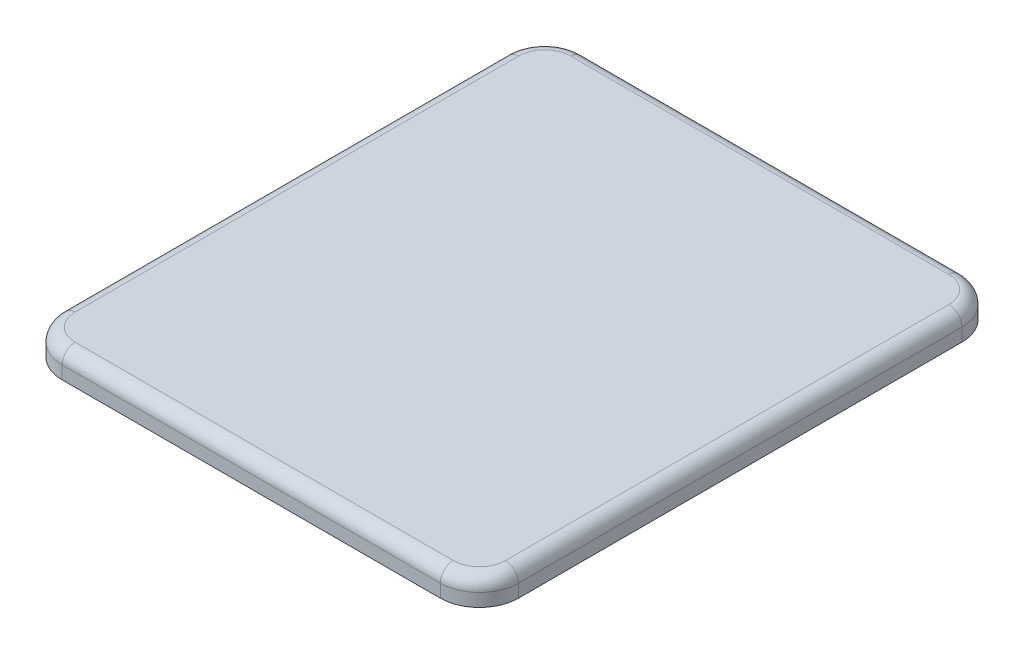
ISO-10303-21;
HEADER;
FILE_DESCRIPTION(('STEP AP214'),'2;1');
FILE_NAME('part.step','',(''),(''),'','','');
FILE_SCHEMA(('AUTOMOTIVE_DESIGN { 1 0 10303 214 1 1 1 1 }'));
ENDSEC;
DATA;
#1=APPLICATION_CONTEXT('core data for automotive mechanical design processes');
#2=APPLICATION_PROTOCOL_DEFINITION('international standard','automotive_design',2000,#1);
#3=PRODUCT_CONTEXT('',#1,'mechanical');
#4=PRODUCT('Part','Part','',(#3));
#5=PRODUCT_RELATED_PRODUCT_CATEGORY('part','',(#4));
#6=PRODUCT_DEFINITION_FORMATION('','',#4);
#7=PRODUCT_DEFINITION_CONTEXT('part definition',#1,'design');
#8=PRODUCT_DEFINITION('design','',#6,#7);
#9=PRODUCT_DEFINITION_SHAPE('','',#8);
#10=(LENGTH_UNIT() NAMED_UNIT(*) SI_UNIT(.MILLI.,.METRE.));
#11=(NAMED_UNIT(*) PLANE_ANGLE_UNIT() SI_UNIT($,.RADIAN.));
#12=(NAMED_UNIT(*) SI_UNIT($,.STERADIAN.) SOLID_ANGLE_UNIT());
#13=UNCERTAINTY_MEASURE_WITH_UNIT(LENGTH_MEASURE(1.E-05),#10,'distance_accuracy_value','');
#14=(GEOMETRIC_REPRESENTATION_CONTEXT(3) GLOBAL_UNCERTAINTY_ASSIGNED_CONTEXT((#13)) GLOBAL_UNIT_ASSIGNED_CONTEXT((#10,
#11,#12)) REPRESENTATION_CONTEXT('',''));
#15=CARTESIAN_POINT('',(0.,0.,0.));
#16=DIRECTION('',(0.,0.,1.));
#17=DIRECTION('',(1.,0.,0.));
#18=AXIS2_PLACEMENT_3D('',#15,#16,#17);
#19=CARTESIAN_POINT('',(-145.,20.,170.));
#20=DIRECTION('',(0.,-1.,0.));
#21=DIRECTION('',(0.,0.,-1.));
#22=AXIS2_PLACEMENT_3D('',#19,#20,#21);
#23=CYLINDRICAL_SURFACE('',#22,30.);
#24=DIRECTION('',(0.,-1.,0.));
#25=VECTOR('',#24,1.);
#26=CARTESIAN_POINT('',(-145.,20.,200.));
#27=LINE('',#26,#25);
#28=CARTESIAN_POINT('',(-145.,10.,200.));
#29=VERTEX_POINT('',#28);
#30=CARTESIAN_POINT('',(-145.,0.,200.));
#31=VERTEX_POINT('',#30);
#32=EDGE_CURVE('E124',#29,#31,#27,.T.);
#33=ORIENTED_EDGE('',*,*,#32,.F.);
#34=CARTESIAN_POINT('',(-145.,10.,170.));
#35=DIRECTION('',(0.,1.,0.));
#36=DIRECTION('',(0.,0.,1.));
#37=AXIS2_PLACEMENT_3D('',#34,#35,#36);
#38=CIRCLE('',#37,30.);
#39=CARTESIAN_POINT('',(-175.,10.,170.));
#40=VERTEX_POINT('',#39);
#41=EDGE_CURVE('E11',#29,#40,#38,.F.);
#42=ORIENTED_EDGE('',*,*,#41,.T.);
#43=DIRECTION('',(0.,-1.,0.));
#44=VECTOR('',#43,1.);
#45=CARTESIAN_POINT('',(-175.,20.,170.));
#46=LINE('',#45,#44);
#47=CARTESIAN_POINT('',(-175.,0.,170.));
#48=VERTEX_POINT('',#47);
#49=EDGE_CURVE('E145',#40,#48,#46,.T.);
#50=ORIENTED_EDGE('',*,*,#49,.T.);
#51=CARTESIAN_POINT('',(-145.,0.,170.));
#52=DIRECTION('',(0.,1.,0.));
#53=DIRECTION('',(0.,0.,1.));
#54=AXIS2_PLACEMENT_3D('',#51,#52,#53);
#55=CIRCLE('',#54,30.);
#56=EDGE_CURVE('E139',#48,#31,#55,.T.);
#57=ORIENTED_EDGE('',*,*,#56,.T.);
#58=EDGE_LOOP('',(#33,#42,#50,#57));
#59=FACE_BOUND('',#58,.T.);
#60=ADVANCED_FACE('F36',(#59),#23,.T.);
#61=CARTESIAN_POINT('',(-145.,20.,200.));
#62=DIRECTION('',(0.,0.,-1.));
#63=DIRECTION('',(-1.,0.,0.));
#64=AXIS2_PLACEMENT_3D('',#61,#62,#63);
#65=PLANE('',#64);
#66=DIRECTION('',(0.,-1.,0.));
#67=VECTOR('',#66,1.);
#68=CARTESIAN_POINT('',(145.,20.,200.));
#69=LINE('',#68,#67);
#70=CARTESIAN_POINT('',(145.,10.,200.));
#71=VERTEX_POINT('',#70);
#72=CARTESIAN_POINT('',(145.,0.,200.));
#73=VERTEX_POINT('',#72);
#74=EDGE_CURVE('E133',#71,#73,#69,.T.);
#75=ORIENTED_EDGE('',*,*,#74,.F.);
#76=DIRECTION('',(1.,0.,0.));
#77=VECTOR('',#76,1.);
#78=CARTESIAN_POINT('',(-145.,10.,200.));
#79=LINE('',#78,#77);
#80=EDGE_CURVE('E45',#71,#29,#79,.F.);
#81=ORIENTED_EDGE('',*,*,#80,.T.);
#82=ORIENTED_EDGE('',*,*,#32,.T.);
#83=DIRECTION('',(1.,0.,0.));
#84=VECTOR('',#83,1.);
#85=CARTESIAN_POINT('',(-145.,0.,200.));
#86=LINE('',#85,#84);
#87=EDGE_CURVE('E127',#31,#73,#86,.T.);
#88=ORIENTED_EDGE('',*,*,#87,.T.);
#89=EDGE_LOOP('',(#75,#81,#82,#88));
#90=FACE_BOUND('',#89,.T.);
#91=ADVANCED_FACE('F126',(#90),#65,.F.);
#92=CARTESIAN_POINT('',(145.,20.,170.));
#93=DIRECTION('',(0.,-1.,0.));
#94=DIRECTION('',(0.,0.,-1.));
#95=AXIS2_PLACEMENT_3D('',#92,#93,#94);
#96=CYLINDRICAL_SURFACE('',#95,30.);
#97=DIRECTION('',(0.,-1.,0.));
#98=VECTOR('',#97,1.);
#99=CARTESIAN_POINT('',(175.,20.,170.));
#100=LINE('',#99,#98);
#101=CARTESIAN_POINT('',(175.,10.,170.));
#102=VERTEX_POINT('',#101);
#103=CARTESIAN_POINT('',(175.,0.,170.));
#104=VERTEX_POINT('',#103);
#105=EDGE_CURVE('E175',#102,#104,#100,.T.);
#106=ORIENTED_EDGE('',*,*,#105,.F.);
#107=CARTESIAN_POINT('',(145.,10.,170.));
#108=DIRECTION('',(0.,1.,0.));
#109=DIRECTION('',(0.,0.,1.));
#110=AXIS2_PLACEMENT_3D('',#107,#108,#109);
#111=CIRCLE('',#110,30.);
#112=EDGE_CURVE('E60',#102,#71,#111,.F.);
#113=ORIENTED_EDGE('',*,*,#112,.T.);
#114=ORIENTED_EDGE('',*,*,#74,.T.);
#115=CARTESIAN_POINT('',(145.,0.,170.));
#116=DIRECTION('',(0.,1.,0.));
#117=DIRECTION('',(0.,0.,1.));
#118=AXIS2_PLACEMENT_3D('',#115,#116,#117);
#119=CIRCLE('',#118,30.);
#120=EDGE_CURVE('E142',#73,#104,#119,.T.);
#121=ORIENTED_EDGE('',*,*,#120,.T.);
#122=EDGE_LOOP('',(#106,#113,#114,#121));
#123=FACE_BOUND('',#122,.T.);
#124=ADVANCED_FACE('F278',(#123),#96,.T.);
#125=CARTESIAN_POINT('',(175.,20.,170.));
#126=DIRECTION('',(-1.,0.,0.));
#127=DIRECTION('',(0.,0.,1.));
#128=AXIS2_PLACEMENT_3D('',#125,#126,#127);
#129=PLANE('',#128);
#130=DIRECTION('',(0.,-1.,0.));
#131=VECTOR('',#130,1.);
#132=CARTESIAN_POINT('',(175.,20.,-170.));
#133=LINE('',#132,#131);
#134=CARTESIAN_POINT('',(175.,10.,-170.));
#135=VERTEX_POINT('',#134);
#136=CARTESIAN_POINT('',(175.,0.,-170.));
#137=VERTEX_POINT('',#136);
#138=EDGE_CURVE('E173',#135,#137,#133,.T.);
#139=ORIENTED_EDGE('',*,*,#138,.F.);
#140=DIRECTION('',(0.,0.,-1.));
#141=VECTOR('',#140,1.);
#142=CARTESIAN_POINT('',(175.,10.,170.));
#143=LINE('',#142,#141);
#144=EDGE_CURVE('E203',#135,#102,#143,.F.);
#145=ORIENTED_EDGE('',*,*,#144,.T.);
#146=ORIENTED_EDGE('',*,*,#105,.T.);
#147=DIRECTION('',(0.,0.,-1.));
#148=VECTOR('',#147,1.);
#149=CARTESIAN_POINT('',(175.,0.,170.));
#150=LINE('',#149,#148);
#151=EDGE_CURVE('E152',#104,#137,#150,.T.);
#152=ORIENTED_EDGE('',*,*,#151,.T.);
#153=EDGE_LOOP('',(#139,#145,#146,#152));
#154=FACE_BOUND('',#153,.T.);
#155=ADVANCED_FACE('F276',(#154),#129,.F.);
#156=CARTESIAN_POINT('',(145.,20.,-170.));
#157=DIRECTION('',(0.,-1.,0.));
#158=DIRECTION('',(0.,0.,-1.));
#159=AXIS2_PLACEMENT_3D('',#156,#157,#158);
#160=CYLINDRICAL_SURFACE('',#159,30.);
#161=DIRECTION('',(0.,-1.,0.));
#162=VECTOR('',#161,1.);
#163=CARTESIAN_POINT('',(145.,20.,-200.));
#164=LINE('',#163,#162);
#165=CARTESIAN_POINT('',(145.,10.,-200.));
#166=VERTEX_POINT('',#165);
#167=CARTESIAN_POINT('',(145.,0.,-200.));
#168=VERTEX_POINT('',#167);
#169=EDGE_CURVE('E171',#166,#168,#164,.T.);
#170=ORIENTED_EDGE('',*,*,#169,.F.);
#171=CARTESIAN_POINT('',(145.,10.,-170.));
#172=DIRECTION('',(0.,1.,0.));
#173=DIRECTION('',(0.,0.,1.));
#174=AXIS2_PLACEMENT_3D('',#171,#172,#173);
#175=CIRCLE('',#174,30.);
#176=EDGE_CURVE('E201',#166,#135,#175,.F.);
#177=ORIENTED_EDGE('',*,*,#176,.T.);
#178=ORIENTED_EDGE('',*,*,#138,.T.);
#179=CARTESIAN_POINT('',(145.,0.,-170.));
#180=DIRECTION('',(0.,1.,0.));
#181=DIRECTION('',(0.,0.,1.));
#182=AXIS2_PLACEMENT_3D('',#179,#180,#181);
#183=CIRCLE('',#182,30.);
#184=EDGE_CURVE('E155',#137,#168,#183,.T.);
#185=ORIENTED_EDGE('',*,*,#184,.T.);
#186=EDGE_LOOP('',(#170,#177,#178,#185));
#187=FACE_BOUND('',#186,.T.);
#188=ADVANCED_FACE('F274',(#187),#160,.T.);
#189=CARTESIAN_POINT('',(-145.,20.,-200.));
#190=DIRECTION('',(0.,0.,1.));
#191=DIRECTION('',(1.,0.,0.));
#192=AXIS2_PLACEMENT_3D('',#189,#190,#191);
#193=PLANE('',#192);
#194=DIRECTION('',(0.,-1.,0.));
#195=VECTOR('',#194,1.);
#196=CARTESIAN_POINT('',(-145.,20.,-200.));
#197=LINE('',#196,#195);
#198=CARTESIAN_POINT('',(-145.,10.,-200.));
#199=VERTEX_POINT('',#198);
#200=CARTESIAN_POINT('',(-145.,0.,-200.));
#201=VERTEX_POINT('',#200);
#202=EDGE_CURVE('E169',#199,#201,#197,.T.);
#203=ORIENTED_EDGE('',*,*,#202,.F.);
#204=DIRECTION('',(-1.,0.,0.));
#205=VECTOR('',#204,1.);
#206=CARTESIAN_POINT('',(145.,10.,-200.));
#207=LINE('',#206,#205);
#208=EDGE_CURVE('E199',#199,#166,#207,.F.);
#209=ORIENTED_EDGE('',*,*,#208,.T.);
#210=ORIENTED_EDGE('',*,*,#169,.T.);
#211=DIRECTION('',(-1.,0.,0.));
#212=VECTOR('',#211,1.);
#213=CARTESIAN_POINT('',(-145.,0.,-200.));
#214=LINE('',#213,#212);
#215=EDGE_CURVE('E158',#168,#201,#214,.T.);
#216=ORIENTED_EDGE('',*,*,#215,.T.);
#217=EDGE_LOOP('',(#203,#209,#210,#216));
#218=FACE_BOUND('',#217,.T.);
#219=ADVANCED_FACE('F262',(#218),#193,.F.);
#220=CARTESIAN_POINT('',(-145.,20.,-170.));
#221=DIRECTION('',(0.,-1.,0.));
#222=DIRECTION('',(0.,0.,-1.));
#223=AXIS2_PLACEMENT_3D('',#220,#221,#222);
#224=CYLINDRICAL_SURFACE('',#223,30.);
#225=DIRECTION('',(0.,-1.,0.));
#226=VECTOR('',#225,1.);
#227=CARTESIAN_POINT('',(-175.,20.,-170.));
#228=LINE('',#227,#226);
#229=CARTESIAN_POINT('',(-175.,10.,-170.));
#230=VERTEX_POINT('',#229);
#231=CARTESIAN_POINT('',(-175.,0.,-170.));
#232=VERTEX_POINT('',#231);
#233=EDGE_CURVE('E167',#230,#232,#228,.T.);
#234=ORIENTED_EDGE('',*,*,#233,.F.);
#235=CARTESIAN_POINT('',(-145.,10.,-170.));
#236=DIRECTION('',(0.,1.,0.));
#237=DIRECTION('',(0.,0.,1.));
#238=AXIS2_PLACEMENT_3D('',#235,#236,#237);
#239=CIRCLE('',#238,30.);
#240=EDGE_CURVE('E197',#230,#199,#239,.F.);
#241=ORIENTED_EDGE('',*,*,#240,.T.);
#242=ORIENTED_EDGE('',*,*,#202,.T.);
#243=CARTESIAN_POINT('',(-145.,0.,-170.));
#244=DIRECTION('',(0.,1.,0.));
#245=DIRECTION('',(0.,0.,1.));
#246=AXIS2_PLACEMENT_3D('',#243,#244,#245);
#247=CIRCLE('',#246,30.);
#248=EDGE_CURVE('E161',#201,#232,#247,.T.);
#249=ORIENTED_EDGE('',*,*,#248,.T.);
#250=EDGE_LOOP('',(#234,#241,#242,#249));
#251=FACE_BOUND('',#250,.T.);
#252=ADVANCED_FACE('F259',(#251),#224,.T.);
#253=CARTESIAN_POINT('',(-175.,20.,170.));
#254=DIRECTION('',(1.,0.,0.));
#255=DIRECTION('',(0.,0.,-1.));
#256=AXIS2_PLACEMENT_3D('',#253,#254,#255);
#257=PLANE('',#256);
#258=ORIENTED_EDGE('',*,*,#49,.F.);
#259=DIRECTION('',(0.,0.,1.));
#260=VECTOR('',#259,1.);
#261=CARTESIAN_POINT('',(-175.,10.,-170.));
#262=LINE('',#261,#260);
#263=EDGE_CURVE('E194',#40,#230,#262,.F.);
#264=ORIENTED_EDGE('',*,*,#263,.T.);
#265=ORIENTED_EDGE('',*,*,#233,.T.);
#266=DIRECTION('',(0.,0.,1.));
#267=VECTOR('',#266,1.);
#268=CARTESIAN_POINT('',(-175.,0.,170.));
#269=LINE('',#268,#267);
#270=EDGE_CURVE('E164',#232,#48,#269,.T.);
#271=ORIENTED_EDGE('',*,*,#270,.T.);
#272=EDGE_LOOP('',(#258,#264,#265,#271));
#273=FACE_BOUND('',#272,.T.);
#274=ADVANCED_FACE('F246',(#273),#257,.F.);
#275=CARTESIAN_POINT('',(-145.,20.,170.));
#276=DIRECTION('',(0.,1.,0.));
#277=DIRECTION('',(0.,0.,1.));
#278=AXIS2_PLACEMENT_3D('',#275,#276,#277);
#279=PLANE('',#278);
#280=CARTESIAN_POINT('',(-145.,20.,-170.));
#281=DIRECTION('',(0.,1.,0.));
#282=DIRECTION('',(0.,0.,1.));
#283=AXIS2_PLACEMENT_3D('',#280,#281,#282);
#284=CIRCLE('',#283,20.);
#285=CARTESIAN_POINT('',(-145.,20.,-190.));
#286=VERTEX_POINT('',#285);
#287=CARTESIAN_POINT('',(-165.,20.,-170.));
#288=VERTEX_POINT('',#287);
#289=EDGE_CURVE('E189',#286,#288,#284,.T.);
#290=ORIENTED_EDGE('',*,*,#289,.T.);
#291=DIRECTION('',(0.,0.,1.));
#292=VECTOR('',#291,1.);
#293=CARTESIAN_POINT('',(-165.,20.,170.));
#294=LINE('',#293,#292);
#295=CARTESIAN_POINT('',(-165.,20.,170.));
#296=VERTEX_POINT('',#295);
#297=EDGE_CURVE('E191',#288,#296,#294,.T.);
#298=ORIENTED_EDGE('',*,*,#297,.T.);
#299=CARTESIAN_POINT('',(-145.,20.,170.));
#300=DIRECTION('',(0.,1.,0.));
#301=DIRECTION('',(0.,0.,1.));
#302=AXIS2_PLACEMENT_3D('',#299,#300,#301);
#303=CIRCLE('',#302,20.);
#304=CARTESIAN_POINT('',(-145.,20.,190.));
#305=VERTEX_POINT('',#304);
#306=EDGE_CURVE('E132',#296,#305,#303,.T.);
#307=ORIENTED_EDGE('',*,*,#306,.T.);
#308=DIRECTION('',(1.,0.,0.));
#309=VECTOR('',#308,1.);
#310=CARTESIAN_POINT('',(145.,20.,190.));
#311=LINE('',#310,#309);
#312=CARTESIAN_POINT('',(145.,20.,190.));
#313=VERTEX_POINT('',#312);
#314=EDGE_CURVE('E179',#305,#313,#311,.T.);
#315=ORIENTED_EDGE('',*,*,#314,.T.);
#316=CARTESIAN_POINT('',(145.,20.,170.));
#317=DIRECTION('',(0.,1.,0.));
#318=DIRECTION('',(0.,0.,1.));
#319=AXIS2_PLACEMENT_3D('',#316,#317,#318);
#320=CIRCLE('',#319,20.);
#321=CARTESIAN_POINT('',(165.,20.,170.));
#322=VERTEX_POINT('',#321);
#323=EDGE_CURVE('E181',#313,#322,#320,.T.);
#324=ORIENTED_EDGE('',*,*,#323,.T.);
#325=DIRECTION('',(0.,0.,-1.));
#326=VECTOR('',#325,1.);
#327=CARTESIAN_POINT('',(165.,20.,-170.));
#328=LINE('',#327,#326);
#329=CARTESIAN_POINT('',(165.,20.,-170.));
#330=VERTEX_POINT('',#329);
#331=EDGE_CURVE('E183',#322,#330,#328,.T.);
#332=ORIENTED_EDGE('',*,*,#331,.T.);
#333=CARTESIAN_POINT('',(145.,20.,-170.));
#334=DIRECTION('',(0.,1.,0.));
#335=DIRECTION('',(0.,0.,1.));
#336=AXIS2_PLACEMENT_3D('',#333,#334,#335);
#337=CIRCLE('',#336,20.);
#338=CARTESIAN_POINT('',(145.,20.,-190.));
#339=VERTEX_POINT('',#338);
#340=EDGE_CURVE('E185',#330,#339,#337,.T.);
#341=ORIENTED_EDGE('',*,*,#340,.T.);
#342=DIRECTION('',(-1.,0.,0.));
#343=VECTOR('',#342,1.);
#344=CARTESIAN_POINT('',(-145.,20.,-190.));
#345=LINE('',#344,#343);
#346=EDGE_CURVE('E187',#339,#286,#345,.T.);
#347=ORIENTED_EDGE('',*,*,#346,.T.);
#348=EDGE_LOOP('',(#290,#298,#307,#315,#324,#332,#341,#347));
#349=FACE_BOUND('',#348,.T.);
#350=ADVANCED_FACE('F234',(#349),#279,.T.);
#351=CARTESIAN_POINT('',(-145.,0.,170.));
#352=DIRECTION('',(0.,1.,0.));
#353=DIRECTION('',(0.,0.,1.));
#354=AXIS2_PLACEMENT_3D('',#351,#352,#353);
#355=PLANE('',#354);
#356=ORIENTED_EDGE('',*,*,#56,.F.);
#357=ORIENTED_EDGE('',*,*,#270,.F.);
#358=ORIENTED_EDGE('',*,*,#248,.F.);
#359=ORIENTED_EDGE('',*,*,#215,.F.);
#360=ORIENTED_EDGE('',*,*,#184,.F.);
#361=ORIENTED_EDGE('',*,*,#151,.F.);
#362=ORIENTED_EDGE('',*,*,#120,.F.);
#363=ORIENTED_EDGE('',*,*,#87,.F.);
#364=EDGE_LOOP('',(#356,#357,#358,#359,#360,#361,#362,#363));
#365=FACE_BOUND('',#364,.T.);
#366=ADVANCED_FACE('F137',(#365),#355,.F.);
#367=CARTESIAN_POINT('',(165.,10.,170.));
#368=DIRECTION('',(0.,0.,1.));
#369=DIRECTION('',(1.,0.,0.));
#370=AXIS2_PLACEMENT_3D('',#367,#368,#369);
#371=CYLINDRICAL_SURFACE('',#370,10.);
#372=CARTESIAN_POINT('',(165.,10.,170.));
#373=DIRECTION('',(0.,0.,1.));
#374=DIRECTION('',(1.,0.,0.));
#375=AXIS2_PLACEMENT_3D('',#372,#373,#374);
#376=CIRCLE('',#375,10.);
#377=EDGE_CURVE('E149',#102,#322,#376,.T.);
#378=ORIENTED_EDGE('',*,*,#377,.F.);
#379=ORIENTED_EDGE('',*,*,#144,.F.);
#380=CARTESIAN_POINT('',(165.,10.,-170.));
#381=DIRECTION('',(0.,0.,-1.));
#382=DIRECTION('',(-1.,0.,0.));
#383=AXIS2_PLACEMENT_3D('',#380,#381,#382);
#384=CIRCLE('',#383,10.);
#385=EDGE_CURVE('E40',#330,#135,#384,.T.);
#386=ORIENTED_EDGE('',*,*,#385,.F.);
#387=ORIENTED_EDGE('',*,*,#331,.F.);
#388=EDGE_LOOP('',(#378,#379,#386,#387));
#389=FACE_BOUND('',#388,.T.);
#390=ADVANCED_FACE('F38',(#389),#371,.T.);
#391=CARTESIAN_POINT('',(145.,10.,-170.));
#392=DIRECTION('',(0.,1.,0.));
#393=DIRECTION('',(0.,0.,1.));
#394=AXIS2_PLACEMENT_3D('',#391,#392,#393);
#395=TOROIDAL_SURFACE('',#394,20.,10.);
#396=ORIENTED_EDGE('',*,*,#385,.T.);
#397=ORIENTED_EDGE('',*,*,#176,.F.);
#398=CARTESIAN_POINT('',(145.,10.,-190.));
#399=DIRECTION('',(-1.,0.,0.));
#400=DIRECTION('',(0.,0.,1.));
#401=AXIS2_PLACEMENT_3D('',#398,#399,#400);
#402=CIRCLE('',#401,10.);
#403=EDGE_CURVE('E220',#339,#166,#402,.T.);
#404=ORIENTED_EDGE('',*,*,#403,.F.);
#405=ORIENTED_EDGE('',*,*,#340,.F.);
#406=EDGE_LOOP('',(#396,#397,#404,#405));
#407=FACE_BOUND('',#406,.T.);
#408=ADVANCED_FACE('F271',(#407),#395,.T.);
#409=CARTESIAN_POINT('',(145.,10.,170.));
#410=DIRECTION('',(0.,1.,0.));
#411=DIRECTION('',(0.,0.,1.));
#412=AXIS2_PLACEMENT_3D('',#409,#410,#411);
#413=TOROIDAL_SURFACE('',#412,20.,10.);
#414=ORIENTED_EDGE('',*,*,#377,.T.);
#415=ORIENTED_EDGE('',*,*,#323,.F.);
#416=CARTESIAN_POINT('',(145.,10.,190.));
#417=DIRECTION('',(-1.,0.,0.));
#418=DIRECTION('',(0.,0.,1.));
#419=AXIS2_PLACEMENT_3D('',#416,#417,#418);
#420=CIRCLE('',#419,10.);
#421=EDGE_CURVE('E217',#71,#313,#420,.T.);
#422=ORIENTED_EDGE('',*,*,#421,.F.);
#423=ORIENTED_EDGE('',*,*,#112,.F.);
#424=EDGE_LOOP('',(#414,#415,#422,#423));
#425=FACE_BOUND('',#424,.T.);
#426=ADVANCED_FACE('F226',(#425),#413,.T.);
#427=CARTESIAN_POINT('',(-145.,10.,-190.));
#428=DIRECTION('',(1.,0.,0.));
#429=DIRECTION('',(0.,0.,-1.));
#430=AXIS2_PLACEMENT_3D('',#427,#428,#429);
#431=CYLINDRICAL_SURFACE('',#430,10.);
#432=ORIENTED_EDGE('',*,*,#403,.T.);
#433=ORIENTED_EDGE('',*,*,#208,.F.);
#434=CARTESIAN_POINT('',(-145.,10.,-190.));
#435=DIRECTION('',(-1.,0.,0.));
#436=DIRECTION('',(0.,0.,1.));
#437=AXIS2_PLACEMENT_3D('',#434,#435,#436);
#438=CIRCLE('',#437,10.);
#439=EDGE_CURVE('E214',#286,#199,#438,.T.);
#440=ORIENTED_EDGE('',*,*,#439,.F.);
#441=ORIENTED_EDGE('',*,*,#346,.F.);
#442=EDGE_LOOP('',(#432,#433,#440,#441));
#443=FACE_BOUND('',#442,.T.);
#444=ADVANCED_FACE('F267',(#443),#431,.T.);
#445=CARTESIAN_POINT('',(-145.,10.,190.));
#446=DIRECTION('',(-1.,0.,0.));
#447=DIRECTION('',(0.,0.,1.));
#448=AXIS2_PLACEMENT_3D('',#445,#446,#447);
#449=CYLINDRICAL_SURFACE('',#448,10.);
#450=ORIENTED_EDGE('',*,*,#421,.T.);
#451=ORIENTED_EDGE('',*,*,#314,.F.);
#452=CARTESIAN_POINT('',(-145.,10.,190.));
#453=DIRECTION('',(-1.,0.,0.));
#454=DIRECTION('',(0.,0.,1.));
#455=AXIS2_PLACEMENT_3D('',#452,#453,#454);
#456=CIRCLE('',#455,10.);
#457=EDGE_CURVE('E211',#29,#305,#456,.T.);
#458=ORIENTED_EDGE('',*,*,#457,.F.);
#459=ORIENTED_EDGE('',*,*,#80,.F.);
#460=EDGE_LOOP('',(#450,#451,#458,#459));
#461=FACE_BOUND('',#460,.T.);
#462=ADVANCED_FACE('F239',(#461),#449,.T.);
#463=CARTESIAN_POINT('',(-145.,10.,-170.));
#464=DIRECTION('',(0.,1.,0.));
#465=DIRECTION('',(0.,0.,1.));
#466=AXIS2_PLACEMENT_3D('',#463,#464,#465);
#467=TOROIDAL_SURFACE('',#466,20.,10.);
#468=ORIENTED_EDGE('',*,*,#439,.T.);
#469=ORIENTED_EDGE('',*,*,#240,.F.);
#470=CARTESIAN_POINT('',(-165.,10.,-170.));
#471=DIRECTION('',(0.,0.,1.));
#472=DIRECTION('',(1.,0.,0.));
#473=AXIS2_PLACEMENT_3D('',#470,#471,#472);
#474=CIRCLE('',#473,10.);
#475=EDGE_CURVE('E209',#288,#230,#474,.T.);
#476=ORIENTED_EDGE('',*,*,#475,.F.);
#477=ORIENTED_EDGE('',*,*,#289,.F.);
#478=EDGE_LOOP('',(#468,#469,#476,#477));
#479=FACE_BOUND('',#478,.T.);
#480=ADVANCED_FACE('F255',(#479),#467,.T.);
#481=CARTESIAN_POINT('',(-145.,10.,170.));
#482=DIRECTION('',(0.,1.,0.));
#483=DIRECTION('',(0.,0.,1.));
#484=AXIS2_PLACEMENT_3D('',#481,#482,#483);
#485=TOROIDAL_SURFACE('',#484,20.,10.);
#486=ORIENTED_EDGE('',*,*,#457,.T.);
#487=ORIENTED_EDGE('',*,*,#306,.F.);
#488=CARTESIAN_POINT('',(-165.,10.,170.));
#489=DIRECTION('',(0.,0.,-1.));
#490=DIRECTION('',(0.,1.,0.));
#491=AXIS2_PLACEMENT_3D('',#488,#489,#490);
#492=CIRCLE('',#491,10.);
#493=EDGE_CURVE('E207',#40,#296,#492,.T.);
#494=ORIENTED_EDGE('',*,*,#493,.F.);
#495=ORIENTED_EDGE('',*,*,#41,.F.);
#496=EDGE_LOOP('',(#486,#487,#494,#495));
#497=FACE_BOUND('',#496,.T.);
#498=ADVANCED_FACE('F242',(#497),#485,.T.);
#499=CARTESIAN_POINT('',(-165.,10.,170.));
#500=DIRECTION('',(0.,0.,-1.));
#501=DIRECTION('',(-1.,0.,0.));
#502=AXIS2_PLACEMENT_3D('',#499,#500,#501);
#503=CYLINDRICAL_SURFACE('',#502,10.);
#504=ORIENTED_EDGE('',*,*,#475,.T.);
#505=ORIENTED_EDGE('',*,*,#263,.F.);
#506=ORIENTED_EDGE('',*,*,#493,.T.);
#507=ORIENTED_EDGE('',*,*,#297,.F.);
#508=EDGE_LOOP('',(#504,#505,#506,#507));
#509=FACE_BOUND('',#508,.T.);
#510=ADVANCED_FACE('F249',(#509),#503,.T.);
#511=CLOSED_SHELL('',(#60,#91,#124,#155,#188,#219,#252,#274,#350,#366,#390,#408,#426,#444,#462,
#480,#498,#510));
#512=MANIFOLD_SOLID_BREP('B2',#511);
#513=ADVANCED_BREP_SHAPE_REPRESENTATION('',(#18,#512),#14);
#514=SHAPE_DEFINITION_REPRESENTATION(#9,#513);
ENDSEC;
END-ISO-10303-21;
